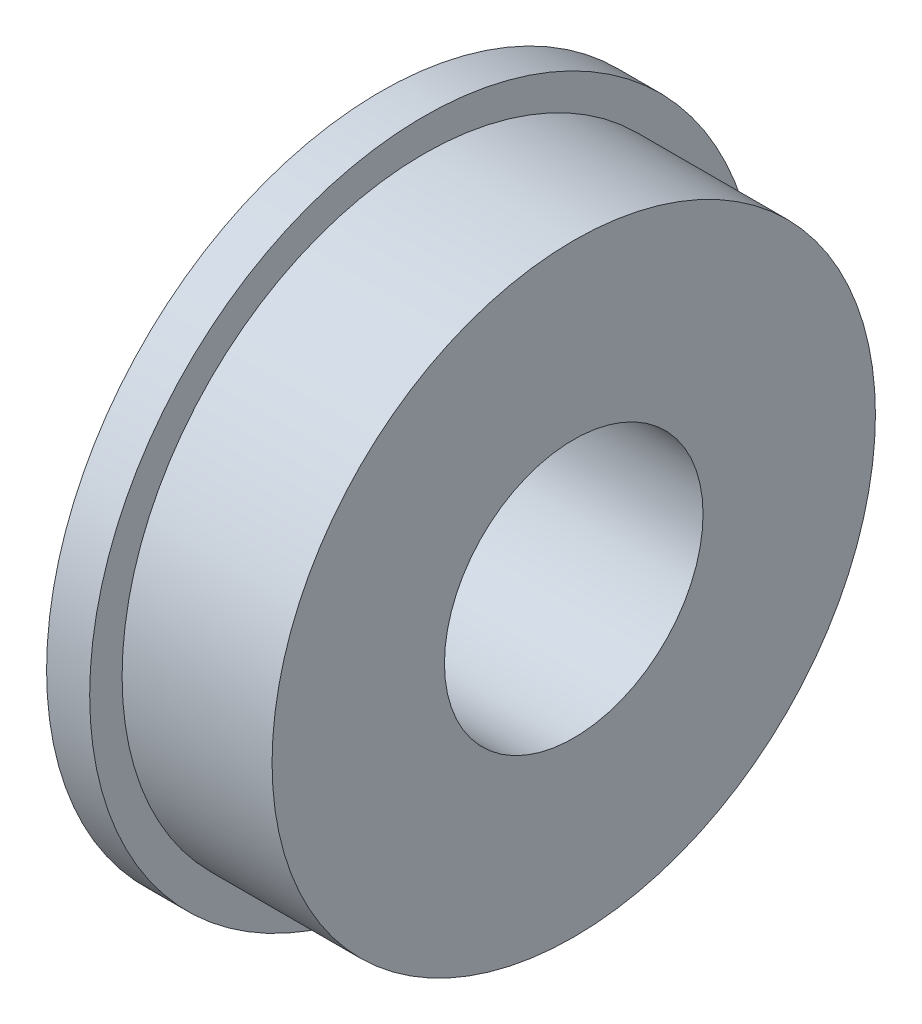
ISO-10303-21;
HEADER;
FILE_DESCRIPTION(('STEP AP214'),'2;1');
FILE_NAME('part.step','',(''),(''),'','','');
FILE_SCHEMA(('AUTOMOTIVE_DESIGN { 1 0 10303 214 1 1 1 1 }'));
ENDSEC;
DATA;
#1=APPLICATION_CONTEXT('core data for automotive mechanical design processes');
#2=APPLICATION_PROTOCOL_DEFINITION('international standard','automotive_design',2000,#1);
#3=PRODUCT_CONTEXT('',#1,'mechanical');
#4=PRODUCT('Part','Part','',(#3));
#5=PRODUCT_RELATED_PRODUCT_CATEGORY('part','',(#4));
#6=PRODUCT_DEFINITION_FORMATION('','',#4);
#7=PRODUCT_DEFINITION_CONTEXT('part definition',#1,'design');
#8=PRODUCT_DEFINITION('design','',#6,#7);
#9=PRODUCT_DEFINITION_SHAPE('','',#8);
#10=(LENGTH_UNIT() NAMED_UNIT(*) SI_UNIT(.MILLI.,.METRE.));
#11=(NAMED_UNIT(*) PLANE_ANGLE_UNIT() SI_UNIT($,.RADIAN.));
#12=(NAMED_UNIT(*) SI_UNIT($,.STERADIAN.) SOLID_ANGLE_UNIT());
#13=UNCERTAINTY_MEASURE_WITH_UNIT(LENGTH_MEASURE(1.E-05),#10,'distance_accuracy_value','');
#14=(GEOMETRIC_REPRESENTATION_CONTEXT(3) GLOBAL_UNCERTAINTY_ASSIGNED_CONTEXT((#13)) GLOBAL_UNIT_ASSIGNED_CONTEXT((#10,
#11,#12)) REPRESENTATION_CONTEXT('',''));
#15=CARTESIAN_POINT('',(0.,0.,0.));
#16=DIRECTION('',(0.,0.,1.));
#17=DIRECTION('',(1.,0.,0.));
#18=AXIS2_PLACEMENT_3D('',#15,#16,#17);
#19=CARTESIAN_POINT('',(0.,0.,0.));
#20=DIRECTION('',(-1.,0.,0.));
#21=DIRECTION('',(0.,0.,1.));
#22=AXIS2_PLACEMENT_3D('',#19,#20,#21);
#23=CYLINDRICAL_SURFACE('',#22,9.906);
#24=CARTESIAN_POINT('',(0.381,0.,0.));
#25=DIRECTION('',(-1.,0.,0.));
#26=DIRECTION('',(0.,0.,1.));
#27=AXIS2_PLACEMENT_3D('',#24,#25,#26);
#28=CIRCLE('',#27,9.906);
#29=CARTESIAN_POINT('',(0.381,0.,9.906));
#30=VERTEX_POINT('',#29);
#31=EDGE_CURVE('E45',#30,#30,#28,.F.);
#32=ORIENTED_EDGE('',*,*,#31,.T.);
#33=EDGE_LOOP('',(#32));
#34=FACE_BOUND('',#33,.T.);
#35=CARTESIAN_POINT('',(0.,0.,0.));
#36=DIRECTION('',(-1.,0.,0.));
#37=DIRECTION('',(0.,0.,1.));
#38=AXIS2_PLACEMENT_3D('',#35,#36,#37);
#39=CIRCLE('',#38,9.906);
#40=CARTESIAN_POINT('',(0.,0.,9.906));
#41=VERTEX_POINT('',#40);
#42=EDGE_CURVE('E17',#41,#41,#39,.T.);
#43=ORIENTED_EDGE('',*,*,#42,.T.);
#44=EDGE_LOOP('',(#43));
#45=FACE_BOUND('',#44,.T.);
#46=ADVANCED_FACE('F14',(#34,#45),#23,.F.);
#47=CARTESIAN_POINT('',(0.,12.3063,0.));
#48=DIRECTION('',(1.,0.,0.));
#49=DIRECTION('',(0.,0.,-1.));
#50=AXIS2_PLACEMENT_3D('',#47,#48,#49);
#51=PLANE('',#50);
#52=CARTESIAN_POINT('',(0.,0.,0.));
#53=DIRECTION('',(-1.,0.,0.));
#54=DIRECTION('',(0.,0.,1.));
#55=AXIS2_PLACEMENT_3D('',#52,#53,#54);
#56=CIRCLE('',#55,12.3063);
#57=CARTESIAN_POINT('',(0.,0.,12.3063));
#58=VERTEX_POINT('',#57);
#59=EDGE_CURVE('E43',#58,#58,#56,.F.);
#60=ORIENTED_EDGE('',*,*,#59,.F.);
#61=EDGE_LOOP('',(#60));
#62=FACE_BOUND('',#61,.T.);
#63=ORIENTED_EDGE('',*,*,#42,.F.);
#64=EDGE_LOOP('',(#63));
#65=FACE_BOUND('',#64,.T.);
#66=ADVANCED_FACE('F53',(#62,#65),#51,.F.);
#67=CARTESIAN_POINT('',(0.381,9.906,0.));
#68=DIRECTION('',(1.,0.,0.));
#69=DIRECTION('',(0.,0.,-1.));
#70=AXIS2_PLACEMENT_3D('',#67,#68,#69);
#71=PLANE('',#70);
#72=ORIENTED_EDGE('',*,*,#31,.F.);
#73=EDGE_LOOP('',(#72));
#74=FACE_BOUND('',#73,.T.);
#75=CARTESIAN_POINT('',(0.381,0.,0.));
#76=DIRECTION('',(-1.,0.,0.));
#77=DIRECTION('',(0.,0.,1.));
#78=AXIS2_PLACEMENT_3D('',#75,#76,#77);
#79=CIRCLE('',#78,6.35);
#80=CARTESIAN_POINT('',(0.381,0.,6.35));
#81=VERTEX_POINT('',#80);
#82=EDGE_CURVE('E40',#81,#81,#79,.T.);
#83=ORIENTED_EDGE('',*,*,#82,.F.);
#84=EDGE_LOOP('',(#83));
#85=FACE_BOUND('',#84,.T.);
#86=ADVANCED_FACE('F55',(#74,#85),#71,.F.);
#87=CARTESIAN_POINT('',(0.,0.,0.));
#88=DIRECTION('',(-1.,0.,0.));
#89=DIRECTION('',(0.,0.,1.));
#90=AXIS2_PLACEMENT_3D('',#87,#88,#89);
#91=CYLINDRICAL_SURFACE('',#90,12.3063);
#92=ORIENTED_EDGE('',*,*,#59,.T.);
#93=EDGE_LOOP('',(#92));
#94=FACE_BOUND('',#93,.T.);
#95=CARTESIAN_POINT('',(1.5875,0.,0.));
#96=DIRECTION('',(-1.,0.,0.));
#97=DIRECTION('',(0.,0.,1.));
#98=AXIS2_PLACEMENT_3D('',#95,#96,#97);
#99=CIRCLE('',#98,12.3063);
#100=CARTESIAN_POINT('',(1.5875,0.,12.3063));
#101=VERTEX_POINT('',#100);
#102=EDGE_CURVE('E37',#101,#101,#99,.T.);
#103=ORIENTED_EDGE('',*,*,#102,.T.);
#104=EDGE_LOOP('',(#103));
#105=FACE_BOUND('',#104,.T.);
#106=ADVANCED_FACE('F62',(#94,#105),#91,.T.);
#107=CARTESIAN_POINT('',(0.,0.,0.));
#108=DIRECTION('',(-1.,0.,0.));
#109=DIRECTION('',(0.,0.,1.));
#110=AXIS2_PLACEMENT_3D('',#107,#108,#109);
#111=CYLINDRICAL_SURFACE('',#110,6.35);
#112=CARTESIAN_POINT('',(0.,0.,0.));
#113=DIRECTION('',(-1.,0.,0.));
#114=DIRECTION('',(0.,0.,1.));
#115=AXIS2_PLACEMENT_3D('',#112,#113,#114);
#116=CIRCLE('',#115,6.35);
#117=CARTESIAN_POINT('',(0.,0.,6.35));
#118=VERTEX_POINT('',#117);
#119=EDGE_CURVE('E34',#118,#118,#116,.F.);
#120=ORIENTED_EDGE('',*,*,#119,.T.);
#121=EDGE_LOOP('',(#120));
#122=FACE_BOUND('',#121,.T.);
#123=ORIENTED_EDGE('',*,*,#82,.T.);
#124=EDGE_LOOP('',(#123));
#125=FACE_BOUND('',#124,.T.);
#126=ADVANCED_FACE('F88',(#122,#125),#111,.T.);
#127=CARTESIAN_POINT('',(1.5875,11.1125,0.));
#128=DIRECTION('',(-1.,0.,0.));
#129=DIRECTION('',(0.,0.,1.));
#130=AXIS2_PLACEMENT_3D('',#127,#128,#129);
#131=PLANE('',#130);
#132=CARTESIAN_POINT('',(1.5875,0.,0.));
#133=DIRECTION('',(-1.,0.,0.));
#134=DIRECTION('',(0.,0.,1.));
#135=AXIS2_PLACEMENT_3D('',#132,#133,#134);
#136=CIRCLE('',#135,11.1125);
#137=CARTESIAN_POINT('',(1.5875,0.,11.1125));
#138=VERTEX_POINT('',#137);
#139=EDGE_CURVE('E31',#138,#138,#136,.F.);
#140=ORIENTED_EDGE('',*,*,#139,.F.);
#141=EDGE_LOOP('',(#140));
#142=FACE_BOUND('',#141,.T.);
#143=ORIENTED_EDGE('',*,*,#102,.F.);
#144=EDGE_LOOP('',(#143));
#145=FACE_BOUND('',#144,.T.);
#146=ADVANCED_FACE('F84',(#142,#145),#131,.F.);
#147=CARTESIAN_POINT('',(0.,6.35,0.));
#148=DIRECTION('',(1.,0.,0.));
#149=DIRECTION('',(0.,0.,-1.));
#150=AXIS2_PLACEMENT_3D('',#147,#148,#149);
#151=PLANE('',#150);
#152=ORIENTED_EDGE('',*,*,#119,.F.);
#153=EDGE_LOOP('',(#152));
#154=FACE_BOUND('',#153,.T.);
#155=CARTESIAN_POINT('',(0.,0.,0.));
#156=DIRECTION('',(-1.,0.,0.));
#157=DIRECTION('',(0.,0.,1.));
#158=AXIS2_PLACEMENT_3D('',#155,#156,#157);
#159=CIRCLE('',#158,4.7625);
#160=CARTESIAN_POINT('',(0.,0.,4.7625));
#161=VERTEX_POINT('',#160);
#162=EDGE_CURVE('E26',#161,#161,#159,.F.);
#163=ORIENTED_EDGE('',*,*,#162,.T.);
#164=EDGE_LOOP('',(#163));
#165=FACE_BOUND('',#164,.T.);
#166=ADVANCED_FACE('F80',(#154,#165),#151,.F.);
#167=CARTESIAN_POINT('',(0.,0.,0.));
#168=DIRECTION('',(-1.,0.,0.));
#169=DIRECTION('',(0.,0.,1.));
#170=AXIS2_PLACEMENT_3D('',#167,#168,#169);
#171=CYLINDRICAL_SURFACE('',#170,11.1125);
#172=ORIENTED_EDGE('',*,*,#139,.T.);
#173=EDGE_LOOP('',(#172));
#174=FACE_BOUND('',#173,.T.);
#175=CARTESIAN_POINT('',(7.112,0.,0.));
#176=DIRECTION('',(-1.,0.,0.));
#177=DIRECTION('',(0.,0.,1.));
#178=AXIS2_PLACEMENT_3D('',#175,#176,#177);
#179=CIRCLE('',#178,11.1125);
#180=CARTESIAN_POINT('',(7.112,0.,11.1125));
#181=VERTEX_POINT('',#180);
#182=EDGE_CURVE('E21',#181,#181,#179,.T.);
#183=ORIENTED_EDGE('',*,*,#182,.T.);
#184=EDGE_LOOP('',(#183));
#185=FACE_BOUND('',#184,.T.);
#186=ADVANCED_FACE('F74',(#174,#185),#171,.T.);
#187=CARTESIAN_POINT('',(0.,0.,0.));
#188=DIRECTION('',(-1.,0.,0.));
#189=DIRECTION('',(0.,0.,1.));
#190=AXIS2_PLACEMENT_3D('',#187,#188,#189);
#191=CYLINDRICAL_SURFACE('',#190,4.7625);
#192=CARTESIAN_POINT('',(7.112,0.,0.));
#193=DIRECTION('',(-1.,0.,0.));
#194=DIRECTION('',(0.,0.,1.));
#195=AXIS2_PLACEMENT_3D('',#192,#193,#194);
#196=CIRCLE('',#195,4.7625);
#197=CARTESIAN_POINT('',(7.112,0.,4.7625));
#198=VERTEX_POINT('',#197);
#199=EDGE_CURVE('E10',#198,#198,#196,.F.);
#200=ORIENTED_EDGE('',*,*,#199,.T.);
#201=EDGE_LOOP('',(#200));
#202=FACE_BOUND('',#201,.T.);
#203=ORIENTED_EDGE('',*,*,#162,.F.);
#204=EDGE_LOOP('',(#203));
#205=FACE_BOUND('',#204,.T.);
#206=ADVANCED_FACE('F68',(#202,#205),#191,.F.);
#207=CARTESIAN_POINT('',(7.112,4.7625,0.));
#208=DIRECTION('',(-1.,0.,0.));
#209=DIRECTION('',(0.,0.,1.));
#210=AXIS2_PLACEMENT_3D('',#207,#208,#209);
#211=PLANE('',#210);
#212=ORIENTED_EDGE('',*,*,#199,.F.);
#213=EDGE_LOOP('',(#212));
#214=FACE_BOUND('',#213,.T.);
#215=ORIENTED_EDGE('',*,*,#182,.F.);
#216=EDGE_LOOP('',(#215));
#217=FACE_BOUND('',#216,.T.);
#218=ADVANCED_FACE('F66',(#214,#217),#211,.F.);
#219=CLOSED_SHELL('',(#46,#66,#86,#106,#126,#146,#166,#186,#206,#218));
#220=MANIFOLD_SOLID_BREP('B1',#219);
#221=ADVANCED_BREP_SHAPE_REPRESENTATION('',(#18,#220),#14);
#222=SHAPE_DEFINITION_REPRESENTATION(#9,#221);
ENDSEC;
END-ISO-10303-21;
